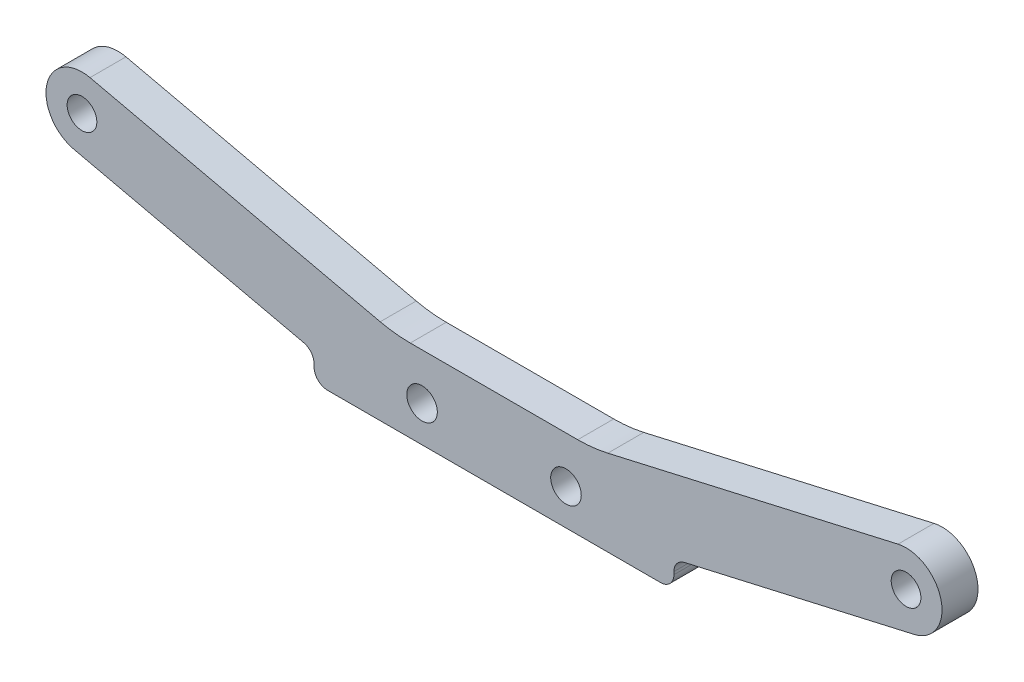
ISO-10303-21;
HEADER;
FILE_DESCRIPTION(('STEP AP214'),'2;1');
FILE_NAME('part.step','',(''),(''),'','','');
FILE_SCHEMA(('AUTOMOTIVE_DESIGN { 1 0 10303 214 1 1 1 1 }'));
ENDSEC;
DATA;
#1=APPLICATION_CONTEXT('core data for automotive mechanical design processes');
#2=APPLICATION_PROTOCOL_DEFINITION('international standard','automotive_design',2000,#1);
#3=PRODUCT_CONTEXT('',#1,'mechanical');
#4=PRODUCT('Part','Part','',(#3));
#5=PRODUCT_RELATED_PRODUCT_CATEGORY('part','',(#4));
#6=PRODUCT_DEFINITION_FORMATION('','',#4);
#7=PRODUCT_DEFINITION_CONTEXT('part definition',#1,'design');
#8=PRODUCT_DEFINITION('design','',#6,#7);
#9=PRODUCT_DEFINITION_SHAPE('','',#8);
#10=(LENGTH_UNIT() NAMED_UNIT(*) SI_UNIT(.MILLI.,.METRE.));
#11=(NAMED_UNIT(*) PLANE_ANGLE_UNIT() SI_UNIT($,.RADIAN.));
#12=(NAMED_UNIT(*) SI_UNIT($,.STERADIAN.) SOLID_ANGLE_UNIT());
#13=UNCERTAINTY_MEASURE_WITH_UNIT(LENGTH_MEASURE(1.E-05),#10,'distance_accuracy_value','');
#14=(GEOMETRIC_REPRESENTATION_CONTEXT(3) GLOBAL_UNCERTAINTY_ASSIGNED_CONTEXT((#13)) GLOBAL_UNIT_ASSIGNED_CONTEXT((#10,
#11,#12)) REPRESENTATION_CONTEXT('',''));
#15=CARTESIAN_POINT('',(0.,0.,0.));
#16=DIRECTION('',(0.,0.,1.));
#17=DIRECTION('',(1.,0.,0.));
#18=AXIS2_PLACEMENT_3D('',#15,#16,#17);
#19=CARTESIAN_POINT('',(21.5,1.80415909984001,2.));
#20=DIRECTION('',(0.,0.,1.));
#21=DIRECTION('',(1.,0.,0.));
#22=AXIS2_PLACEMENT_3D('',#19,#20,#21);
#23=PLANE('',#22);
#24=CARTESIAN_POINT('',(45.8,13.,2.));
#25=DIRECTION('',(0.,0.,1.));
#26=DIRECTION('',(1.,0.,0.));
#27=AXIS2_PLACEMENT_3D('',#24,#25,#26);
#28=CIRCLE('',#27,1.65);
#29=CARTESIAN_POINT('',(47.45,13.,2.));
#30=VERTEX_POINT('',#29);
#31=EDGE_CURVE('E335',#30,#30,#28,.T.);
#32=ORIENTED_EDGE('',*,*,#31,.F.);
#33=EDGE_LOOP('',(#32));
#34=FACE_BOUND('',#33,.T.);
#35=CARTESIAN_POINT('',(-45.8,13.,2.));
#36=DIRECTION('',(0.,0.,1.));
#37=DIRECTION('',(1.,0.,0.));
#38=AXIS2_PLACEMENT_3D('',#35,#36,#37);
#39=CIRCLE('',#38,1.65);
#40=CARTESIAN_POINT('',(-44.15,13.,2.));
#41=VERTEX_POINT('',#40);
#42=EDGE_CURVE('E337',#41,#41,#39,.T.);
#43=ORIENTED_EDGE('',*,*,#42,.F.);
#44=EDGE_LOOP('',(#43));
#45=FACE_BOUND('',#44,.T.);
#46=CARTESIAN_POINT('',(-8.,3.99999999999999,2.));
#47=DIRECTION('',(0.,0.,1.));
#48=DIRECTION('',(1.,0.,0.));
#49=AXIS2_PLACEMENT_3D('',#46,#47,#48);
#50=CIRCLE('',#49,1.69999999999999);
#51=CARTESIAN_POINT('',(-6.30000000000001,3.99999999999999,2.));
#52=VERTEX_POINT('',#51);
#53=EDGE_CURVE('E345',#52,#52,#50,.T.);
#54=ORIENTED_EDGE('',*,*,#53,.F.);
#55=EDGE_LOOP('',(#54));
#56=FACE_BOUND('',#55,.T.);
#57=CARTESIAN_POINT('',(8.,3.99999999999999,2.));
#58=DIRECTION('',(0.,0.,1.));
#59=DIRECTION('',(1.,0.,0.));
#60=AXIS2_PLACEMENT_3D('',#57,#58,#59);
#61=CIRCLE('',#60,1.69999999999999);
#62=CARTESIAN_POINT('',(9.69999999999999,3.99999999999999,2.));
#63=VERTEX_POINT('',#62);
#64=EDGE_CURVE('E351',#63,#63,#61,.T.);
#65=ORIENTED_EDGE('',*,*,#64,.F.);
#66=EDGE_LOOP('',(#65));
#67=FACE_BOUND('',#66,.T.);
#68=CARTESIAN_POINT('',(21.5,1.80415909984001,2.));
#69=DIRECTION('',(0.,0.,-1.));
#70=DIRECTION('',(1.,0.,0.));
#71=AXIS2_PLACEMENT_3D('',#68,#69,#70);
#72=CIRCLE('',#71,1.5);
#73=CARTESIAN_POINT('',(20.,1.80415909984001,2.));
#74=VERTEX_POINT('',#73);
#75=CARTESIAN_POINT('',(21.165778543134,3.26645045855427,2.));
#76=VERTEX_POINT('',#75);
#77=EDGE_CURVE('E208',#74,#76,#72,.T.);
#78=ORIENTED_EDGE('',*,*,#77,.T.);
#79=DIRECTION('',(0.974860905809502,0.222814304577326,0.));
#80=VECTOR('',#79,1.);
#81=CARTESIAN_POINT('',(46.6912572183093,9.10055637676198,2.));
#82=LINE('',#81,#80);
#83=CARTESIAN_POINT('',(46.6912572183093,9.10055637676198,2.));
#84=VERTEX_POINT('',#83);
#85=EDGE_CURVE('E117',#76,#84,#82,.T.);
#86=ORIENTED_EDGE('',*,*,#85,.T.);
#87=CARTESIAN_POINT('',(45.8,13.,2.));
#88=DIRECTION('',(0.,0.,1.));
#89=DIRECTION('',(-1.,0.,0.));
#90=AXIS2_PLACEMENT_3D('',#87,#88,#89);
#91=CIRCLE('',#90,4.);
#92=CARTESIAN_POINT('',(44.9087427816907,16.899443623238,2.));
#93=VERTEX_POINT('',#92);
#94=EDGE_CURVE('E247',#84,#93,#91,.T.);
#95=ORIENTED_EDGE('',*,*,#94,.T.);
#96=DIRECTION('',(-0.974860905809502,-0.222814304577326,0.));
#97=VECTOR('',#96,1.);
#98=CARTESIAN_POINT('',(44.9087427816907,16.899443623238,2.));
#99=LINE('',#98,#97);
#100=CARTESIAN_POINT('',(12.6498348375973,9.52634444862435,2.));
#101=VERTEX_POINT('',#100);
#102=EDGE_CURVE('E265',#93,#101,#99,.T.);
#103=ORIENTED_EDGE('',*,*,#102,.T.);
#104=CARTESIAN_POINT('',(9.30762026893739,24.1492580357669,2.));
#105=DIRECTION('',(0.,0.,-1.));
#106=DIRECTION('',(-1.,0.,0.));
#107=AXIS2_PLACEMENT_3D('',#104,#105,#106);
#108=CIRCLE('',#107,15.);
#109=CARTESIAN_POINT('',(9.30762026893739,9.14925803576688,2.));
#110=VERTEX_POINT('',#109);
#111=EDGE_CURVE('E262',#101,#110,#108,.T.);
#112=ORIENTED_EDGE('',*,*,#111,.T.);
#113=DIRECTION('',(-1.,0.,0.));
#114=VECTOR('',#113,1.);
#115=CARTESIAN_POINT('',(-9.30762026893739,9.14925803576688,2.));
#116=LINE('',#115,#114);
#117=CARTESIAN_POINT('',(-9.30762026893739,9.14925803576688,2.));
#118=VERTEX_POINT('',#117);
#119=EDGE_CURVE('E264',#110,#118,#116,.T.);
#120=ORIENTED_EDGE('',*,*,#119,.T.);
#121=CARTESIAN_POINT('',(-9.30762026893739,24.1492580357669,2.));
#122=DIRECTION('',(0.,0.,-1.));
#123=DIRECTION('',(1.,0.,0.));
#124=AXIS2_PLACEMENT_3D('',#121,#122,#123);
#125=CIRCLE('',#124,15.);
#126=CARTESIAN_POINT('',(-12.6498348375973,9.52634444862435,2.));
#127=VERTEX_POINT('',#126);
#128=EDGE_CURVE('E267',#118,#127,#125,.T.);
#129=ORIENTED_EDGE('',*,*,#128,.T.);
#130=DIRECTION('',(-0.974860905809502,0.222814304577326,0.));
#131=VECTOR('',#130,1.);
#132=CARTESIAN_POINT('',(-44.9087427816907,16.899443623238,2.));
#133=LINE('',#132,#131);
#134=CARTESIAN_POINT('',(-44.9087427816907,16.899443623238,2.));
#135=VERTEX_POINT('',#134);
#136=EDGE_CURVE('E273',#127,#135,#133,.T.);
#137=ORIENTED_EDGE('',*,*,#136,.T.);
#138=CARTESIAN_POINT('',(-45.8,13.,2.));
#139=DIRECTION('',(0.,0.,1.));
#140=DIRECTION('',(1.,0.,0.));
#141=AXIS2_PLACEMENT_3D('',#138,#139,#140);
#142=CIRCLE('',#141,4.);
#143=CARTESIAN_POINT('',(-46.6912572183093,9.10055637676198,2.));
#144=VERTEX_POINT('',#143);
#145=EDGE_CURVE('E275',#135,#144,#142,.T.);
#146=ORIENTED_EDGE('',*,*,#145,.T.);
#147=DIRECTION('',(0.974860905809502,-0.222814304577326,0.));
#148=VECTOR('',#147,1.);
#149=CARTESIAN_POINT('',(-46.6912572183093,9.10055637676198,2.));
#150=LINE('',#149,#148);
#151=CARTESIAN_POINT('',(-21.165778543134,3.26645045855427,2.));
#152=VERTEX_POINT('',#151);
#153=EDGE_CURVE('E277',#144,#152,#150,.T.);
#154=ORIENTED_EDGE('',*,*,#153,.T.);
#155=CARTESIAN_POINT('',(-21.5,1.80415909984001,2.));
#156=DIRECTION('',(0.,0.,-1.));
#157=DIRECTION('',(-1.,0.,0.));
#158=AXIS2_PLACEMENT_3D('',#155,#156,#157);
#159=CIRCLE('',#158,1.5);
#160=CARTESIAN_POINT('',(-20.,1.80415909984001,2.));
#161=VERTEX_POINT('',#160);
#162=EDGE_CURVE('E279',#152,#161,#159,.T.);
#163=ORIENTED_EDGE('',*,*,#162,.T.);
#164=DIRECTION('',(0.,-1.,0.));
#165=VECTOR('',#164,1.);
#166=CARTESIAN_POINT('',(-20.,1.80415909984001,2.));
#167=LINE('',#166,#165);
#168=CARTESIAN_POINT('',(-20.,1.50000000000001,2.));
#169=VERTEX_POINT('',#168);
#170=EDGE_CURVE('E281',#161,#169,#167,.T.);
#171=ORIENTED_EDGE('',*,*,#170,.T.);
#172=CARTESIAN_POINT('',(-18.5,1.5,2.));
#173=DIRECTION('',(0.,0.,1.));
#174=DIRECTION('',(1.,0.,0.));
#175=AXIS2_PLACEMENT_3D('',#172,#173,#174);
#176=CIRCLE('',#175,1.5);
#177=CARTESIAN_POINT('',(-18.5,0.,2.));
#178=VERTEX_POINT('',#177);
#179=EDGE_CURVE('E159',#169,#178,#176,.T.);
#180=ORIENTED_EDGE('',*,*,#179,.T.);
#181=DIRECTION('',(1.,0.,0.));
#182=VECTOR('',#181,1.);
#183=CARTESIAN_POINT('',(-18.5,0.,2.));
#184=LINE('',#183,#182);
#185=CARTESIAN_POINT('',(18.5,0.,2.));
#186=VERTEX_POINT('',#185);
#187=EDGE_CURVE('E154',#178,#186,#184,.T.);
#188=ORIENTED_EDGE('',*,*,#187,.T.);
#189=CARTESIAN_POINT('',(18.5,1.5,2.));
#190=DIRECTION('',(0.,0.,1.));
#191=DIRECTION('',(-1.,0.,0.));
#192=AXIS2_PLACEMENT_3D('',#189,#190,#191);
#193=CIRCLE('',#192,1.5);
#194=CARTESIAN_POINT('',(20.,1.50000000000001,2.));
#195=VERTEX_POINT('',#194);
#196=EDGE_CURVE('E157',#186,#195,#193,.T.);
#197=ORIENTED_EDGE('',*,*,#196,.T.);
#198=DIRECTION('',(0.,1.,0.));
#199=VECTOR('',#198,1.);
#200=CARTESIAN_POINT('',(20.,1.80415909984001,2.));
#201=LINE('',#200,#199);
#202=EDGE_CURVE('E50',#195,#74,#201,.T.);
#203=ORIENTED_EDGE('',*,*,#202,.T.);
#204=EDGE_LOOP('',(#78,#86,#95,#103,#112,#120,#129,#137,#146,#154,#163,#171,#180,#188,#197,#203));
#205=FACE_BOUND('',#204,.T.);
#206=ADVANCED_FACE('F33',(#34,#45,#56,#67,#205),#23,.T.);
#207=CARTESIAN_POINT('',(21.5,1.80415909984001,-2.));
#208=DIRECTION('',(0.,0.,1.));
#209=DIRECTION('',(1.,0.,0.));
#210=AXIS2_PLACEMENT_3D('',#207,#208,#209);
#211=PLANE('',#210);
#212=CARTESIAN_POINT('',(45.8,13.,-2.));
#213=DIRECTION('',(0.,0.,1.));
#214=DIRECTION('',(1.,0.,0.));
#215=AXIS2_PLACEMENT_3D('',#212,#213,#214);
#216=CIRCLE('',#215,1.65);
#217=CARTESIAN_POINT('',(47.45,13.,-2.));
#218=VERTEX_POINT('',#217);
#219=EDGE_CURVE('E333',#218,#218,#216,.T.);
#220=ORIENTED_EDGE('',*,*,#219,.T.);
#221=EDGE_LOOP('',(#220));
#222=FACE_BOUND('',#221,.T.);
#223=CARTESIAN_POINT('',(-45.8,13.,-2.));
#224=DIRECTION('',(0.,0.,1.));
#225=DIRECTION('',(1.,0.,0.));
#226=AXIS2_PLACEMENT_3D('',#223,#224,#225);
#227=CIRCLE('',#226,1.65);
#228=CARTESIAN_POINT('',(-44.15,13.,-2.));
#229=VERTEX_POINT('',#228);
#230=EDGE_CURVE('E342',#229,#229,#227,.T.);
#231=ORIENTED_EDGE('',*,*,#230,.T.);
#232=EDGE_LOOP('',(#231));
#233=FACE_BOUND('',#232,.T.);
#234=CARTESIAN_POINT('',(-8.,3.99999999999999,-2.));
#235=DIRECTION('',(0.,0.,1.));
#236=DIRECTION('',(1.,0.,0.));
#237=AXIS2_PLACEMENT_3D('',#234,#235,#236);
#238=CIRCLE('',#237,1.7);
#239=CARTESIAN_POINT('',(-6.3,3.99999999999999,-2.));
#240=VERTEX_POINT('',#239);
#241=EDGE_CURVE('E348',#240,#240,#238,.T.);
#242=ORIENTED_EDGE('',*,*,#241,.T.);
#243=EDGE_LOOP('',(#242));
#244=FACE_BOUND('',#243,.T.);
#245=CARTESIAN_POINT('',(8.,3.99999999999999,-2.));
#246=DIRECTION('',(0.,0.,1.));
#247=DIRECTION('',(1.,0.,0.));
#248=AXIS2_PLACEMENT_3D('',#245,#246,#247);
#249=CIRCLE('',#248,1.7);
#250=CARTESIAN_POINT('',(9.7,3.99999999999999,-2.));
#251=VERTEX_POINT('',#250);
#252=EDGE_CURVE('E181',#251,#251,#249,.T.);
#253=ORIENTED_EDGE('',*,*,#252,.T.);
#254=EDGE_LOOP('',(#253));
#255=FACE_BOUND('',#254,.T.);
#256=CARTESIAN_POINT('',(21.5,1.80415909984001,-2.));
#257=DIRECTION('',(0.,0.,-1.));
#258=DIRECTION('',(1.,0.,0.));
#259=AXIS2_PLACEMENT_3D('',#256,#257,#258);
#260=CIRCLE('',#259,1.5);
#261=CARTESIAN_POINT('',(20.,1.80415909984001,-2.));
#262=VERTEX_POINT('',#261);
#263=CARTESIAN_POINT('',(21.165778543134,3.26645045855427,-2.));
#264=VERTEX_POINT('',#263);
#265=EDGE_CURVE('E177',#262,#264,#260,.T.);
#266=ORIENTED_EDGE('',*,*,#265,.F.);
#267=DIRECTION('',(0.,1.,0.));
#268=VECTOR('',#267,1.);
#269=CARTESIAN_POINT('',(20.,1.80415909984001,-2.));
#270=LINE('',#269,#268);
#271=CARTESIAN_POINT('',(20.,1.50000000000001,-2.));
#272=VERTEX_POINT('',#271);
#273=EDGE_CURVE('E109',#272,#262,#270,.T.);
#274=ORIENTED_EDGE('',*,*,#273,.F.);
#275=CARTESIAN_POINT('',(18.5,1.5,-2.));
#276=DIRECTION('',(0.,0.,1.));
#277=DIRECTION('',(-1.,0.,0.));
#278=AXIS2_PLACEMENT_3D('',#275,#276,#277);
#279=CIRCLE('',#278,1.5);
#280=CARTESIAN_POINT('',(18.5,0.,-2.));
#281=VERTEX_POINT('',#280);
#282=EDGE_CURVE('E103',#281,#272,#279,.T.);
#283=ORIENTED_EDGE('',*,*,#282,.F.);
#284=DIRECTION('',(1.,0.,0.));
#285=VECTOR('',#284,1.);
#286=CARTESIAN_POINT('',(-18.5,0.,-2.));
#287=LINE('',#286,#285);
#288=CARTESIAN_POINT('',(-18.5,0.,-2.));
#289=VERTEX_POINT('',#288);
#290=EDGE_CURVE('E167',#289,#281,#287,.T.);
#291=ORIENTED_EDGE('',*,*,#290,.F.);
#292=CARTESIAN_POINT('',(-18.5,1.5,-2.));
#293=DIRECTION('',(0.,0.,1.));
#294=DIRECTION('',(1.,0.,0.));
#295=AXIS2_PLACEMENT_3D('',#292,#293,#294);
#296=CIRCLE('',#295,1.5);
#297=CARTESIAN_POINT('',(-20.,1.50000000000001,-2.));
#298=VERTEX_POINT('',#297);
#299=EDGE_CURVE('E203',#298,#289,#296,.T.);
#300=ORIENTED_EDGE('',*,*,#299,.F.);
#301=DIRECTION('',(0.,-1.,0.));
#302=VECTOR('',#301,1.);
#303=CARTESIAN_POINT('',(-20.,1.80415909984001,-2.));
#304=LINE('',#303,#302);
#305=CARTESIAN_POINT('',(-20.,1.80415909984001,-2.));
#306=VERTEX_POINT('',#305);
#307=EDGE_CURVE('E201',#306,#298,#304,.T.);
#308=ORIENTED_EDGE('',*,*,#307,.F.);
#309=CARTESIAN_POINT('',(-21.5,1.80415909984001,-2.));
#310=DIRECTION('',(0.,0.,-1.));
#311=DIRECTION('',(-1.,0.,0.));
#312=AXIS2_PLACEMENT_3D('',#309,#310,#311);
#313=CIRCLE('',#312,1.5);
#314=CARTESIAN_POINT('',(-21.165778543134,3.26645045855427,-2.));
#315=VERTEX_POINT('',#314);
#316=EDGE_CURVE('E199',#315,#306,#313,.T.);
#317=ORIENTED_EDGE('',*,*,#316,.F.);
#318=DIRECTION('',(0.974860905809502,-0.222814304577326,0.));
#319=VECTOR('',#318,1.);
#320=CARTESIAN_POINT('',(-46.6912572183093,9.10055637676198,-2.));
#321=LINE('',#320,#319);
#322=CARTESIAN_POINT('',(-46.6912572183093,9.10055637676198,-2.));
#323=VERTEX_POINT('',#322);
#324=EDGE_CURVE('E197',#323,#315,#321,.T.);
#325=ORIENTED_EDGE('',*,*,#324,.F.);
#326=CARTESIAN_POINT('',(-45.8,13.,-2.));
#327=DIRECTION('',(0.,0.,1.));
#328=DIRECTION('',(1.,0.,0.));
#329=AXIS2_PLACEMENT_3D('',#326,#327,#328);
#330=CIRCLE('',#329,4.);
#331=CARTESIAN_POINT('',(-44.9087427816907,16.899443623238,-2.));
#332=VERTEX_POINT('',#331);
#333=EDGE_CURVE('E195',#332,#323,#330,.T.);
#334=ORIENTED_EDGE('',*,*,#333,.F.);
#335=DIRECTION('',(-0.974860905809502,0.222814304577326,0.));
#336=VECTOR('',#335,1.);
#337=CARTESIAN_POINT('',(-44.9087427816907,16.899443623238,-2.));
#338=LINE('',#337,#336);
#339=CARTESIAN_POINT('',(-12.6498348375973,9.52634444862435,-2.));
#340=VERTEX_POINT('',#339);
#341=EDGE_CURVE('E193',#340,#332,#338,.T.);
#342=ORIENTED_EDGE('',*,*,#341,.F.);
#343=CARTESIAN_POINT('',(-9.30762026893739,24.1492580357669,-2.));
#344=DIRECTION('',(0.,0.,-1.));
#345=DIRECTION('',(1.,0.,0.));
#346=AXIS2_PLACEMENT_3D('',#343,#344,#345);
#347=CIRCLE('',#346,15.);
#348=CARTESIAN_POINT('',(-9.30762026893739,9.14925803576688,-2.));
#349=VERTEX_POINT('',#348);
#350=EDGE_CURVE('E191',#349,#340,#347,.T.);
#351=ORIENTED_EDGE('',*,*,#350,.F.);
#352=DIRECTION('',(-1.,0.,0.));
#353=VECTOR('',#352,1.);
#354=CARTESIAN_POINT('',(-9.30762026893739,9.14925803576688,-2.));
#355=LINE('',#354,#353);
#356=CARTESIAN_POINT('',(9.30762026893739,9.14925803576688,-2.));
#357=VERTEX_POINT('',#356);
#358=EDGE_CURVE('E189',#357,#349,#355,.T.);
#359=ORIENTED_EDGE('',*,*,#358,.F.);
#360=CARTESIAN_POINT('',(9.30762026893739,24.1492580357669,-2.));
#361=DIRECTION('',(0.,0.,-1.));
#362=DIRECTION('',(-1.,0.,0.));
#363=AXIS2_PLACEMENT_3D('',#360,#361,#362);
#364=CIRCLE('',#363,15.);
#365=CARTESIAN_POINT('',(12.6498348375973,9.52634444862435,-2.));
#366=VERTEX_POINT('',#365);
#367=EDGE_CURVE('E187',#366,#357,#364,.T.);
#368=ORIENTED_EDGE('',*,*,#367,.F.);
#369=DIRECTION('',(-0.974860905809502,-0.222814304577326,0.));
#370=VECTOR('',#369,1.);
#371=CARTESIAN_POINT('',(44.9087427816907,16.899443623238,-2.));
#372=LINE('',#371,#370);
#373=CARTESIAN_POINT('',(44.9087427816907,16.899443623238,-2.));
#374=VERTEX_POINT('',#373);
#375=EDGE_CURVE('E185',#374,#366,#372,.T.);
#376=ORIENTED_EDGE('',*,*,#375,.F.);
#377=CARTESIAN_POINT('',(45.8,13.,-2.));
#378=DIRECTION('',(0.,0.,1.));
#379=DIRECTION('',(-1.,0.,0.));
#380=AXIS2_PLACEMENT_3D('',#377,#378,#379);
#381=CIRCLE('',#380,4.);
#382=CARTESIAN_POINT('',(46.6912572183093,9.10055637676198,-2.));
#383=VERTEX_POINT('',#382);
#384=EDGE_CURVE('E183',#383,#374,#381,.T.);
#385=ORIENTED_EDGE('',*,*,#384,.F.);
#386=DIRECTION('',(0.974860905809502,0.222814304577326,0.));
#387=VECTOR('',#386,1.);
#388=CARTESIAN_POINT('',(46.6912572183093,9.10055637676198,-2.));
#389=LINE('',#388,#387);
#390=EDGE_CURVE('E180',#264,#383,#389,.T.);
#391=ORIENTED_EDGE('',*,*,#390,.F.);
#392=EDGE_LOOP('',(#266,#274,#283,#291,#300,#308,#317,#325,#334,#342,#351,#359,#368,#376,#385,#391));
#393=FACE_BOUND('',#392,.T.);
#394=ADVANCED_FACE('F251',(#222,#233,#244,#255,#393),#211,.F.);
#395=CARTESIAN_POINT('',(21.5,1.80415909984001,2.));
#396=DIRECTION('',(0.,0.,-1.));
#397=DIRECTION('',(-1.,0.,0.));
#398=AXIS2_PLACEMENT_3D('',#395,#396,#397);
#399=CYLINDRICAL_SURFACE('',#398,1.5);
#400=ORIENTED_EDGE('',*,*,#265,.T.);
#401=DIRECTION('',(0.,0.,-1.));
#402=VECTOR('',#401,1.);
#403=CARTESIAN_POINT('',(21.165778543134,3.26645045855427,2.));
#404=LINE('',#403,#402);
#405=EDGE_CURVE('E11',#76,#264,#404,.T.);
#406=ORIENTED_EDGE('',*,*,#405,.F.);
#407=ORIENTED_EDGE('',*,*,#77,.F.);
#408=DIRECTION('',(0.,0.,-1.));
#409=VECTOR('',#408,1.);
#410=CARTESIAN_POINT('',(20.,1.80415909984001,2.));
#411=LINE('',#410,#409);
#412=EDGE_CURVE('E173',#74,#262,#411,.T.);
#413=ORIENTED_EDGE('',*,*,#412,.T.);
#414=EDGE_LOOP('',(#400,#406,#407,#413));
#415=FACE_BOUND('',#414,.T.);
#416=ADVANCED_FACE('F35',(#415),#399,.F.);
#417=CARTESIAN_POINT('',(46.6912572183093,9.10055637676198,2.));
#418=DIRECTION('',(-0.222814304577326,0.974860905809502,0.));
#419=DIRECTION('',(-0.974860905809502,-0.222814304577326,0.));
#420=AXIS2_PLACEMENT_3D('',#417,#418,#419);
#421=PLANE('',#420);
#422=ORIENTED_EDGE('',*,*,#390,.T.);
#423=DIRECTION('',(0.,0.,-1.));
#424=VECTOR('',#423,1.);
#425=CARTESIAN_POINT('',(46.6912572183093,9.10055637676198,2.));
#426=LINE('',#425,#424);
#427=EDGE_CURVE('E42',#84,#383,#426,.T.);
#428=ORIENTED_EDGE('',*,*,#427,.F.);
#429=ORIENTED_EDGE('',*,*,#85,.F.);
#430=ORIENTED_EDGE('',*,*,#405,.T.);
#431=EDGE_LOOP('',(#422,#428,#429,#430));
#432=FACE_BOUND('',#431,.T.);
#433=ADVANCED_FACE('F503',(#432),#421,.F.);
#434=CARTESIAN_POINT('',(45.8,13.,2.));
#435=DIRECTION('',(0.,0.,-1.));
#436=DIRECTION('',(-1.,0.,0.));
#437=AXIS2_PLACEMENT_3D('',#434,#435,#436);
#438=CYLINDRICAL_SURFACE('',#437,4.);
#439=ORIENTED_EDGE('',*,*,#384,.T.);
#440=DIRECTION('',(0.,0.,-1.));
#441=VECTOR('',#440,1.);
#442=CARTESIAN_POINT('',(44.9087427816907,16.899443623238,2.));
#443=LINE('',#442,#441);
#444=EDGE_CURVE('E239',#93,#374,#443,.T.);
#445=ORIENTED_EDGE('',*,*,#444,.F.);
#446=ORIENTED_EDGE('',*,*,#94,.F.);
#447=ORIENTED_EDGE('',*,*,#427,.T.);
#448=EDGE_LOOP('',(#439,#445,#446,#447));
#449=FACE_BOUND('',#448,.T.);
#450=ADVANCED_FACE('F245',(#449),#438,.T.);
#451=CARTESIAN_POINT('',(44.9087427816907,16.899443623238,2.));
#452=DIRECTION('',(0.222814304577326,-0.974860905809502,0.));
#453=DIRECTION('',(0.974860905809502,0.222814304577326,0.));
#454=AXIS2_PLACEMENT_3D('',#451,#452,#453);
#455=PLANE('',#454);
#456=ORIENTED_EDGE('',*,*,#375,.T.);
#457=DIRECTION('',(0.,0.,-1.));
#458=VECTOR('',#457,1.);
#459=CARTESIAN_POINT('',(12.6498348375973,9.52634444862435,2.));
#460=LINE('',#459,#458);
#461=EDGE_CURVE('E236',#101,#366,#460,.T.);
#462=ORIENTED_EDGE('',*,*,#461,.F.);
#463=ORIENTED_EDGE('',*,*,#102,.F.);
#464=ORIENTED_EDGE('',*,*,#444,.T.);
#465=EDGE_LOOP('',(#456,#462,#463,#464));
#466=FACE_BOUND('',#465,.T.);
#467=ADVANCED_FACE('F256',(#466),#455,.F.);
#468=CARTESIAN_POINT('',(9.30762026893739,24.1492580357669,2.));
#469=DIRECTION('',(0.,0.,-1.));
#470=DIRECTION('',(-1.,0.,0.));
#471=AXIS2_PLACEMENT_3D('',#468,#469,#470);
#472=CYLINDRICAL_SURFACE('',#471,15.);
#473=ORIENTED_EDGE('',*,*,#367,.T.);
#474=DIRECTION('',(0.,0.,-1.));
#475=VECTOR('',#474,1.);
#476=CARTESIAN_POINT('',(9.30762026893739,9.14925803576688,2.));
#477=LINE('',#476,#475);
#478=EDGE_CURVE('E233',#110,#357,#477,.T.);
#479=ORIENTED_EDGE('',*,*,#478,.F.);
#480=ORIENTED_EDGE('',*,*,#111,.F.);
#481=ORIENTED_EDGE('',*,*,#461,.T.);
#482=EDGE_LOOP('',(#473,#479,#480,#481));
#483=FACE_BOUND('',#482,.T.);
#484=ADVANCED_FACE('F260',(#483),#472,.F.);
#485=CARTESIAN_POINT('',(-9.30762026893739,9.14925803576688,2.));
#486=DIRECTION('',(0.,-1.,0.));
#487=DIRECTION('',(0.,0.,-1.));
#488=AXIS2_PLACEMENT_3D('',#485,#486,#487);
#489=PLANE('',#488);
#490=ORIENTED_EDGE('',*,*,#358,.T.);
#491=DIRECTION('',(0.,0.,-1.));
#492=VECTOR('',#491,1.);
#493=CARTESIAN_POINT('',(-9.30762026893739,9.14925803576688,2.));
#494=LINE('',#493,#492);
#495=EDGE_CURVE('E230',#118,#349,#494,.T.);
#496=ORIENTED_EDGE('',*,*,#495,.F.);
#497=ORIENTED_EDGE('',*,*,#119,.F.);
#498=ORIENTED_EDGE('',*,*,#478,.T.);
#499=EDGE_LOOP('',(#490,#496,#497,#498));
#500=FACE_BOUND('',#499,.T.);
#501=ADVANCED_FACE('F468',(#500),#489,.F.);
#502=CARTESIAN_POINT('',(-9.30762026893739,24.1492580357669,2.));
#503=DIRECTION('',(0.,0.,-1.));
#504=DIRECTION('',(-1.,0.,0.));
#505=AXIS2_PLACEMENT_3D('',#502,#503,#504);
#506=CYLINDRICAL_SURFACE('',#505,15.);
#507=ORIENTED_EDGE('',*,*,#350,.T.);
#508=DIRECTION('',(0.,0.,-1.));
#509=VECTOR('',#508,1.);
#510=CARTESIAN_POINT('',(-12.6498348375973,9.52634444862435,2.));
#511=LINE('',#510,#509);
#512=EDGE_CURVE('E227',#127,#340,#511,.T.);
#513=ORIENTED_EDGE('',*,*,#512,.F.);
#514=ORIENTED_EDGE('',*,*,#128,.F.);
#515=ORIENTED_EDGE('',*,*,#495,.T.);
#516=EDGE_LOOP('',(#507,#513,#514,#515));
#517=FACE_BOUND('',#516,.T.);
#518=ADVANCED_FACE('F458',(#517),#506,.F.);
#519=CARTESIAN_POINT('',(-44.9087427816907,16.899443623238,2.));
#520=DIRECTION('',(-0.222814304577326,-0.974860905809502,0.));
#521=DIRECTION('',(0.974860905809502,-0.222814304577326,0.));
#522=AXIS2_PLACEMENT_3D('',#519,#520,#521);
#523=PLANE('',#522);
#524=ORIENTED_EDGE('',*,*,#341,.T.);
#525=DIRECTION('',(0.,0.,-1.));
#526=VECTOR('',#525,1.);
#527=CARTESIAN_POINT('',(-44.9087427816907,16.899443623238,2.));
#528=LINE('',#527,#526);
#529=EDGE_CURVE('E224',#135,#332,#528,.T.);
#530=ORIENTED_EDGE('',*,*,#529,.F.);
#531=ORIENTED_EDGE('',*,*,#136,.F.);
#532=ORIENTED_EDGE('',*,*,#512,.T.);
#533=EDGE_LOOP('',(#524,#530,#531,#532));
#534=FACE_BOUND('',#533,.T.);
#535=ADVANCED_FACE('F448',(#534),#523,.F.);
#536=CARTESIAN_POINT('',(-45.8,13.,2.));
#537=DIRECTION('',(0.,0.,-1.));
#538=DIRECTION('',(-1.,0.,0.));
#539=AXIS2_PLACEMENT_3D('',#536,#537,#538);
#540=CYLINDRICAL_SURFACE('',#539,4.);
#541=ORIENTED_EDGE('',*,*,#333,.T.);
#542=DIRECTION('',(0.,0.,-1.));
#543=VECTOR('',#542,1.);
#544=CARTESIAN_POINT('',(-46.6912572183093,9.10055637676198,2.));
#545=LINE('',#544,#543);
#546=EDGE_CURVE('E221',#144,#323,#545,.T.);
#547=ORIENTED_EDGE('',*,*,#546,.F.);
#548=ORIENTED_EDGE('',*,*,#145,.F.);
#549=ORIENTED_EDGE('',*,*,#529,.T.);
#550=EDGE_LOOP('',(#541,#547,#548,#549));
#551=FACE_BOUND('',#550,.T.);
#552=ADVANCED_FACE('F438',(#551),#540,.T.);
#553=CARTESIAN_POINT('',(-46.6912572183093,9.10055637676198,2.));
#554=DIRECTION('',(0.222814304577326,0.974860905809502,0.));
#555=DIRECTION('',(-0.974860905809502,0.222814304577326,0.));
#556=AXIS2_PLACEMENT_3D('',#553,#554,#555);
#557=PLANE('',#556);
#558=ORIENTED_EDGE('',*,*,#324,.T.);
#559=DIRECTION('',(0.,0.,-1.));
#560=VECTOR('',#559,1.);
#561=CARTESIAN_POINT('',(-21.165778543134,3.26645045855427,2.));
#562=LINE('',#561,#560);
#563=EDGE_CURVE('E218',#152,#315,#562,.T.);
#564=ORIENTED_EDGE('',*,*,#563,.F.);
#565=ORIENTED_EDGE('',*,*,#153,.F.);
#566=ORIENTED_EDGE('',*,*,#546,.T.);
#567=EDGE_LOOP('',(#558,#564,#565,#566));
#568=FACE_BOUND('',#567,.T.);
#569=ADVANCED_FACE('F428',(#568),#557,.F.);
#570=CARTESIAN_POINT('',(-21.5,1.80415909984001,2.));
#571=DIRECTION('',(0.,0.,-1.));
#572=DIRECTION('',(-1.,0.,0.));
#573=AXIS2_PLACEMENT_3D('',#570,#571,#572);
#574=CYLINDRICAL_SURFACE('',#573,1.5);
#575=ORIENTED_EDGE('',*,*,#316,.T.);
#576=DIRECTION('',(0.,0.,-1.));
#577=VECTOR('',#576,1.);
#578=CARTESIAN_POINT('',(-20.,1.80415909984001,2.));
#579=LINE('',#578,#577);
#580=EDGE_CURVE('E215',#161,#306,#579,.T.);
#581=ORIENTED_EDGE('',*,*,#580,.F.);
#582=ORIENTED_EDGE('',*,*,#162,.F.);
#583=ORIENTED_EDGE('',*,*,#563,.T.);
#584=EDGE_LOOP('',(#575,#581,#582,#583));
#585=FACE_BOUND('',#584,.T.);
#586=ADVANCED_FACE('F419',(#585),#574,.F.);
#587=CARTESIAN_POINT('',(-20.,1.80415909984001,2.));
#588=DIRECTION('',(1.,0.,0.));
#589=DIRECTION('',(0.,0.,-1.));
#590=AXIS2_PLACEMENT_3D('',#587,#588,#589);
#591=PLANE('',#590);
#592=ORIENTED_EDGE('',*,*,#307,.T.);
#593=DIRECTION('',(0.,0.,-1.));
#594=VECTOR('',#593,1.);
#595=CARTESIAN_POINT('',(-20.,1.50000000000001,2.));
#596=LINE('',#595,#594);
#597=EDGE_CURVE('E212',#169,#298,#596,.T.);
#598=ORIENTED_EDGE('',*,*,#597,.F.);
#599=ORIENTED_EDGE('',*,*,#170,.F.);
#600=ORIENTED_EDGE('',*,*,#580,.T.);
#601=EDGE_LOOP('',(#592,#598,#599,#600));
#602=FACE_BOUND('',#601,.T.);
#603=ADVANCED_FACE('F287',(#602),#591,.F.);
#604=CARTESIAN_POINT('',(-18.5,1.5,2.));
#605=DIRECTION('',(0.,0.,-1.));
#606=DIRECTION('',(-1.,0.,0.));
#607=AXIS2_PLACEMENT_3D('',#604,#605,#606);
#608=CYLINDRICAL_SURFACE('',#607,1.5);
#609=ORIENTED_EDGE('',*,*,#299,.T.);
#610=DIRECTION('',(0.,0.,-1.));
#611=VECTOR('',#610,1.);
#612=CARTESIAN_POINT('',(-18.5,0.,2.));
#613=LINE('',#612,#611);
#614=EDGE_CURVE('E168',#178,#289,#613,.T.);
#615=ORIENTED_EDGE('',*,*,#614,.F.);
#616=ORIENTED_EDGE('',*,*,#179,.F.);
#617=ORIENTED_EDGE('',*,*,#597,.T.);
#618=EDGE_LOOP('',(#609,#615,#616,#617));
#619=FACE_BOUND('',#618,.T.);
#620=ADVANCED_FACE('F291',(#619),#608,.T.);
#621=CARTESIAN_POINT('',(-18.5,0.,2.));
#622=DIRECTION('',(0.,1.,0.));
#623=DIRECTION('',(0.,0.,1.));
#624=AXIS2_PLACEMENT_3D('',#621,#622,#623);
#625=PLANE('',#624);
#626=ORIENTED_EDGE('',*,*,#290,.T.);
#627=DIRECTION('',(0.,0.,-1.));
#628=VECTOR('',#627,1.);
#629=CARTESIAN_POINT('',(18.5,0.,2.));
#630=LINE('',#629,#628);
#631=EDGE_CURVE('E164',#186,#281,#630,.T.);
#632=ORIENTED_EDGE('',*,*,#631,.F.);
#633=ORIENTED_EDGE('',*,*,#187,.F.);
#634=ORIENTED_EDGE('',*,*,#614,.T.);
#635=EDGE_LOOP('',(#626,#632,#633,#634));
#636=FACE_BOUND('',#635,.T.);
#637=ADVANCED_FACE('F165',(#636),#625,.F.);
#638=CARTESIAN_POINT('',(18.5,1.5,2.));
#639=DIRECTION('',(0.,0.,-1.));
#640=DIRECTION('',(-1.,0.,0.));
#641=AXIS2_PLACEMENT_3D('',#638,#639,#640);
#642=CYLINDRICAL_SURFACE('',#641,1.5);
#643=ORIENTED_EDGE('',*,*,#282,.T.);
#644=DIRECTION('',(0.,0.,-1.));
#645=VECTOR('',#644,1.);
#646=CARTESIAN_POINT('',(20.,1.50000000000001,2.));
#647=LINE('',#646,#645);
#648=EDGE_CURVE('E169',#195,#272,#647,.T.);
#649=ORIENTED_EDGE('',*,*,#648,.F.);
#650=ORIENTED_EDGE('',*,*,#196,.F.);
#651=ORIENTED_EDGE('',*,*,#631,.T.);
#652=EDGE_LOOP('',(#643,#649,#650,#651));
#653=FACE_BOUND('',#652,.T.);
#654=ADVANCED_FACE('F171',(#653),#642,.T.);
#655=CARTESIAN_POINT('',(20.,1.80415909984001,2.));
#656=DIRECTION('',(-1.,0.,0.));
#657=DIRECTION('',(0.,0.,1.));
#658=AXIS2_PLACEMENT_3D('',#655,#656,#657);
#659=PLANE('',#658);
#660=ORIENTED_EDGE('',*,*,#273,.T.);
#661=ORIENTED_EDGE('',*,*,#412,.F.);
#662=ORIENTED_EDGE('',*,*,#202,.F.);
#663=ORIENTED_EDGE('',*,*,#648,.T.);
#664=EDGE_LOOP('',(#660,#661,#662,#663));
#665=FACE_BOUND('',#664,.T.);
#666=ADVANCED_FACE('F295',(#665),#659,.F.);
#667=CARTESIAN_POINT('',(8.,3.99999999999999,2.));
#668=DIRECTION('',(0.,0.,1.));
#669=DIRECTION('',(1.,0.,0.));
#670=AXIS2_PLACEMENT_3D('',#667,#668,#669);
#671=CYLINDRICAL_SURFACE('',#670,1.69999999999999);
#672=ORIENTED_EDGE('',*,*,#252,.F.);
#673=EDGE_LOOP('',(#672));
#674=FACE_BOUND('',#673,.T.);
#675=ORIENTED_EDGE('',*,*,#64,.T.);
#676=EDGE_LOOP('',(#675));
#677=FACE_BOUND('',#676,.T.);
#678=ADVANCED_FACE('F297',(#674,#677),#671,.F.);
#679=CARTESIAN_POINT('',(-8.,3.99999999999999,2.));
#680=DIRECTION('',(0.,0.,1.));
#681=DIRECTION('',(1.,0.,0.));
#682=AXIS2_PLACEMENT_3D('',#679,#680,#681);
#683=CYLINDRICAL_SURFACE('',#682,1.69999999999999);
#684=ORIENTED_EDGE('',*,*,#241,.F.);
#685=EDGE_LOOP('',(#684));
#686=FACE_BOUND('',#685,.T.);
#687=ORIENTED_EDGE('',*,*,#53,.T.);
#688=EDGE_LOOP('',(#687));
#689=FACE_BOUND('',#688,.T.);
#690=ADVANCED_FACE('F303',(#686,#689),#683,.F.);
#691=CARTESIAN_POINT('',(-45.8,13.,2.));
#692=DIRECTION('',(0.,0.,1.));
#693=DIRECTION('',(1.,0.,0.));
#694=AXIS2_PLACEMENT_3D('',#691,#692,#693);
#695=CYLINDRICAL_SURFACE('',#694,1.65);
#696=ORIENTED_EDGE('',*,*,#230,.F.);
#697=EDGE_LOOP('',(#696));
#698=FACE_BOUND('',#697,.T.);
#699=ORIENTED_EDGE('',*,*,#42,.T.);
#700=EDGE_LOOP('',(#699));
#701=FACE_BOUND('',#700,.T.);
#702=ADVANCED_FACE('F320',(#698,#701),#695,.F.);
#703=CARTESIAN_POINT('',(45.8,13.,2.));
#704=DIRECTION('',(0.,0.,1.));
#705=DIRECTION('',(1.,0.,0.));
#706=AXIS2_PLACEMENT_3D('',#703,#704,#705);
#707=CYLINDRICAL_SURFACE('',#706,1.65);
#708=ORIENTED_EDGE('',*,*,#219,.F.);
#709=EDGE_LOOP('',(#708));
#710=FACE_BOUND('',#709,.T.);
#711=ORIENTED_EDGE('',*,*,#31,.T.);
#712=EDGE_LOOP('',(#711));
#713=FACE_BOUND('',#712,.T.);
#714=ADVANCED_FACE('F324',(#710,#713),#707,.F.);
#715=CLOSED_SHELL('',(#206,#394,#416,#433,#450,#467,#484,#501,#518,#535,#552,#569,#586,#603,
#620,#637,#654,#666,#678,#690,#702,#714));
#716=MANIFOLD_SOLID_BREP('B2',#715);
#717=ADVANCED_BREP_SHAPE_REPRESENTATION('',(#18,#716),#14);
#718=SHAPE_DEFINITION_REPRESENTATION(#9,#717);
ENDSEC;
END-ISO-10303-21;
